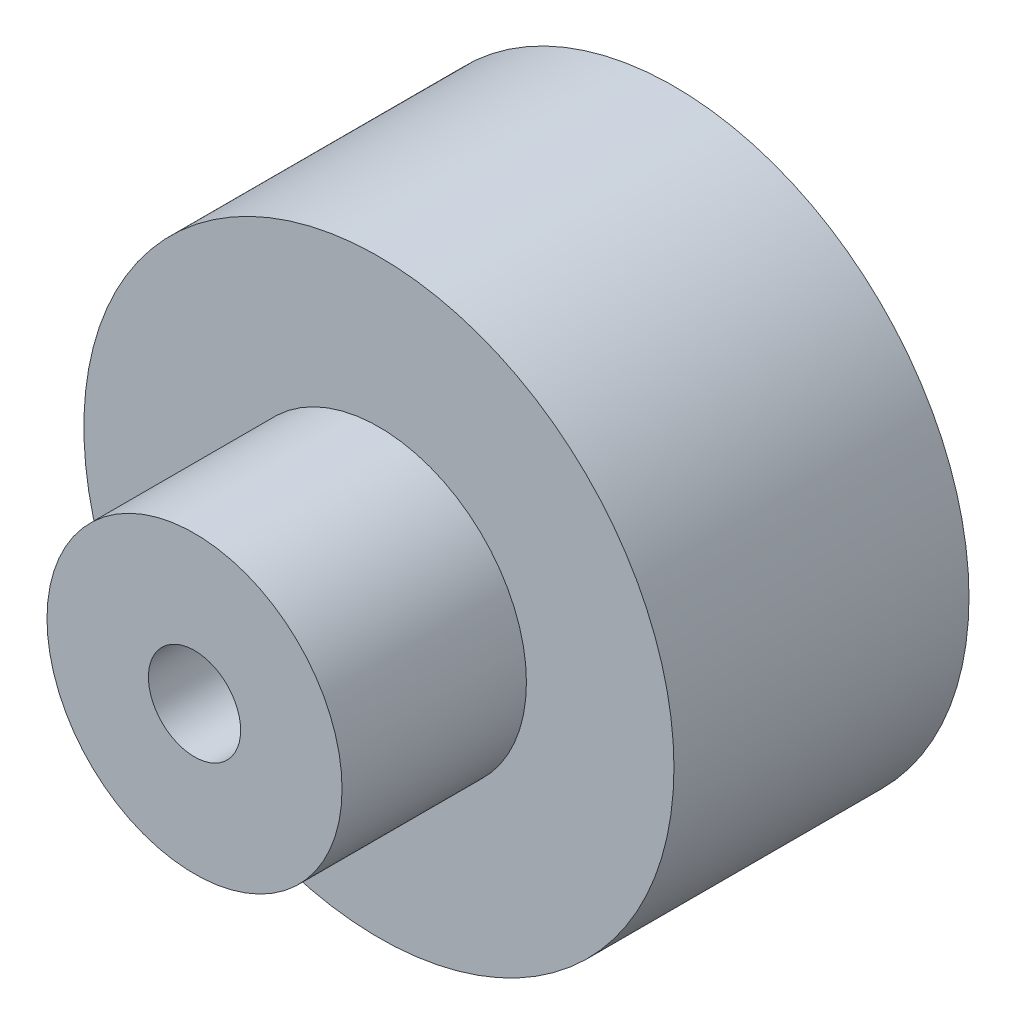
ISO-10303-21;
HEADER;
FILE_DESCRIPTION(('STEP AP214'),'2;1');
FILE_NAME('part.step','',(''),(''),'','','');
FILE_SCHEMA(('AUTOMOTIVE_DESIGN { 1 0 10303 214 1 1 1 1 }'));
ENDSEC;
DATA;
#1=APPLICATION_CONTEXT('core data for automotive mechanical design processes');
#2=APPLICATION_PROTOCOL_DEFINITION('international standard','automotive_design',2000,#1);
#3=PRODUCT_CONTEXT('',#1,'mechanical');
#4=PRODUCT('Part','Part','',(#3));
#5=PRODUCT_RELATED_PRODUCT_CATEGORY('part','',(#4));
#6=PRODUCT_DEFINITION_FORMATION('','',#4);
#7=PRODUCT_DEFINITION_CONTEXT('part definition',#1,'design');
#8=PRODUCT_DEFINITION('design','',#6,#7);
#9=PRODUCT_DEFINITION_SHAPE('','',#8);
#10=(LENGTH_UNIT() NAMED_UNIT(*) SI_UNIT(.MILLI.,.METRE.));
#11=(NAMED_UNIT(*) PLANE_ANGLE_UNIT() SI_UNIT($,.RADIAN.));
#12=(NAMED_UNIT(*) SI_UNIT($,.STERADIAN.) SOLID_ANGLE_UNIT());
#13=UNCERTAINTY_MEASURE_WITH_UNIT(LENGTH_MEASURE(1.E-05),#10,'distance_accuracy_value','');
#14=(GEOMETRIC_REPRESENTATION_CONTEXT(3) GLOBAL_UNCERTAINTY_ASSIGNED_CONTEXT((#13)) GLOBAL_UNIT_ASSIGNED_CONTEXT((#10,
#11,#12)) REPRESENTATION_CONTEXT('',''));
#15=CARTESIAN_POINT('',(0.,0.,0.));
#16=DIRECTION('',(0.,0.,1.));
#17=DIRECTION('',(1.,0.,0.));
#18=AXIS2_PLACEMENT_3D('',#15,#16,#17);
#19=CARTESIAN_POINT('',(0.,0.,8.));
#20=DIRECTION('',(0.,0.,-1.));
#21=DIRECTION('',(-1.,0.,0.));
#22=AXIS2_PLACEMENT_3D('',#19,#20,#21);
#23=CYLINDRICAL_SURFACE('',#22,8.);
#24=CARTESIAN_POINT('',(0.,0.,8.));
#25=DIRECTION('',(0.,0.,1.));
#26=DIRECTION('',(1.,0.,0.));
#27=AXIS2_PLACEMENT_3D('',#24,#25,#26);
#28=CIRCLE('',#27,8.);
#29=CARTESIAN_POINT('',(8.,0.,8.));
#30=VERTEX_POINT('',#29);
#31=EDGE_CURVE('E11',#30,#30,#28,.T.);
#32=ORIENTED_EDGE('',*,*,#31,.F.);
#33=EDGE_LOOP('',(#32));
#34=FACE_BOUND('',#33,.T.);
#35=CARTESIAN_POINT('',(0.,0.,0.));
#36=DIRECTION('',(0.,0.,1.));
#37=DIRECTION('',(1.,0.,0.));
#38=AXIS2_PLACEMENT_3D('',#35,#36,#37);
#39=CIRCLE('',#38,8.);
#40=CARTESIAN_POINT('',(8.,0.,0.));
#41=VERTEX_POINT('',#40);
#42=EDGE_CURVE('E38',#41,#41,#39,.T.);
#43=ORIENTED_EDGE('',*,*,#42,.T.);
#44=EDGE_LOOP('',(#43));
#45=FACE_BOUND('',#44,.T.);
#46=ADVANCED_FACE('F35',(#34,#45),#23,.T.);
#47=CARTESIAN_POINT('',(0.,0.,8.));
#48=DIRECTION('',(0.,0.,1.));
#49=DIRECTION('',(1.,0.,0.));
#50=AXIS2_PLACEMENT_3D('',#47,#48,#49);
#51=PLANE('',#50);
#52=CARTESIAN_POINT('',(0.,0.,8.));
#53=DIRECTION('',(0.,0.,1.));
#54=DIRECTION('',(1.,0.,0.));
#55=AXIS2_PLACEMENT_3D('',#52,#53,#54);
#56=CIRCLE('',#55,4.);
#57=CARTESIAN_POINT('',(4.,0.,8.));
#58=VERTEX_POINT('',#57);
#59=EDGE_CURVE('E54',#58,#58,#56,.T.);
#60=ORIENTED_EDGE('',*,*,#59,.F.);
#61=EDGE_LOOP('',(#60));
#62=FACE_BOUND('',#61,.T.);
#63=ORIENTED_EDGE('',*,*,#31,.T.);
#64=EDGE_LOOP('',(#63));
#65=FACE_BOUND('',#64,.T.);
#66=ADVANCED_FACE('F73',(#62,#65),#51,.T.);
#67=CARTESIAN_POINT('',(0.,0.,0.));
#68=DIRECTION('',(0.,0.,1.));
#69=DIRECTION('',(1.,0.,0.));
#70=AXIS2_PLACEMENT_3D('',#67,#68,#69);
#71=PLANE('',#70);
#72=ORIENTED_EDGE('',*,*,#42,.F.);
#73=EDGE_LOOP('',(#72));
#74=FACE_BOUND('',#73,.T.);
#75=ADVANCED_FACE('F70',(#74),#71,.F.);
#76=CARTESIAN_POINT('',(0.,0.,13.));
#77=DIRECTION('',(0.,0.,-1.));
#78=DIRECTION('',(-1.,0.,0.));
#79=AXIS2_PLACEMENT_3D('',#76,#77,#78);
#80=CYLINDRICAL_SURFACE('',#79,4.);
#81=CARTESIAN_POINT('',(0.,0.,13.));
#82=DIRECTION('',(0.,0.,1.));
#83=DIRECTION('',(1.,0.,0.));
#84=AXIS2_PLACEMENT_3D('',#81,#82,#83);
#85=CIRCLE('',#84,4.);
#86=CARTESIAN_POINT('',(4.,0.,13.));
#87=VERTEX_POINT('',#86);
#88=EDGE_CURVE('E58',#87,#87,#85,.T.);
#89=ORIENTED_EDGE('',*,*,#88,.F.);
#90=EDGE_LOOP('',(#89));
#91=FACE_BOUND('',#90,.T.);
#92=ORIENTED_EDGE('',*,*,#59,.T.);
#93=EDGE_LOOP('',(#92));
#94=FACE_BOUND('',#93,.T.);
#95=ADVANCED_FACE('F72',(#91,#94),#80,.T.);
#96=CARTESIAN_POINT('',(0.,0.,13.));
#97=DIRECTION('',(0.,0.,1.));
#98=DIRECTION('',(1.,0.,0.));
#99=AXIS2_PLACEMENT_3D('',#96,#97,#98);
#100=PLANE('',#99);
#101=CARTESIAN_POINT('',(0.,0.,13.));
#102=DIRECTION('',(0.,0.,1.));
#103=DIRECTION('',(1.,0.,0.));
#104=AXIS2_PLACEMENT_3D('',#101,#102,#103);
#105=CIRCLE('',#104,1.24999999999999);
#106=CARTESIAN_POINT('',(1.24999999999999,0.,13.));
#107=VERTEX_POINT('',#106);
#108=EDGE_CURVE('E55',#107,#107,#105,.T.);
#109=ORIENTED_EDGE('',*,*,#108,.F.);
#110=EDGE_LOOP('',(#109));
#111=FACE_BOUND('',#110,.T.);
#112=ORIENTED_EDGE('',*,*,#88,.T.);
#113=EDGE_LOOP('',(#112));
#114=FACE_BOUND('',#113,.T.);
#115=ADVANCED_FACE('F48',(#111,#114),#100,.T.);
#116=CARTESIAN_POINT('',(0.,0.,4.5));
#117=DIRECTION('',(0.,0.,1.));
#118=DIRECTION('',(1.,0.,0.));
#119=AXIS2_PLACEMENT_3D('',#116,#117,#118);
#120=CONICAL_SURFACE('',#119,1.25,1.02974425867665);
#121=CARTESIAN_POINT('',(0.,0.,3.74892422621555));
#122=VERTEX_POINT('',#121);
#123=VERTEX_LOOP('',#122);
#124=FACE_BOUND('',#123,.T.);
#125=CARTESIAN_POINT('',(0.,0.,4.5));
#126=DIRECTION('',(0.,0.,1.));
#127=DIRECTION('',(1.,0.,0.));
#128=AXIS2_PLACEMENT_3D('',#125,#126,#127);
#129=CIRCLE('',#128,1.25);
#130=CARTESIAN_POINT('',(1.25,0.,4.5));
#131=VERTEX_POINT('',#130);
#132=EDGE_CURVE('E52',#131,#131,#129,.T.);
#133=ORIENTED_EDGE('',*,*,#132,.T.);
#134=EDGE_LOOP('',(#133));
#135=FACE_BOUND('',#134,.T.);
#136=ADVANCED_FACE('F44',(#124,#135),#120,.F.);
#137=CARTESIAN_POINT('',(0.,0.,13.));
#138=DIRECTION('',(0.,0.,1.));
#139=DIRECTION('',(1.,0.,0.));
#140=AXIS2_PLACEMENT_3D('',#137,#138,#139);
#141=CYLINDRICAL_SURFACE('',#140,1.24999999999999);
#142=ORIENTED_EDGE('',*,*,#132,.F.);
#143=EDGE_LOOP('',(#142));
#144=FACE_BOUND('',#143,.T.);
#145=ORIENTED_EDGE('',*,*,#108,.T.);
#146=EDGE_LOOP('',(#145));
#147=FACE_BOUND('',#146,.T.);
#148=ADVANCED_FACE('F47',(#144,#147),#141,.F.);
#149=CLOSED_SHELL('',(#46,#66,#75,#95,#115,#136,#148));
#150=MANIFOLD_SOLID_BREP('B2',#149);
#151=ADVANCED_BREP_SHAPE_REPRESENTATION('',(#18,#150),#14);
#152=SHAPE_DEFINITION_REPRESENTATION(#9,#151);
ENDSEC;
END-ISO-10303-21;
